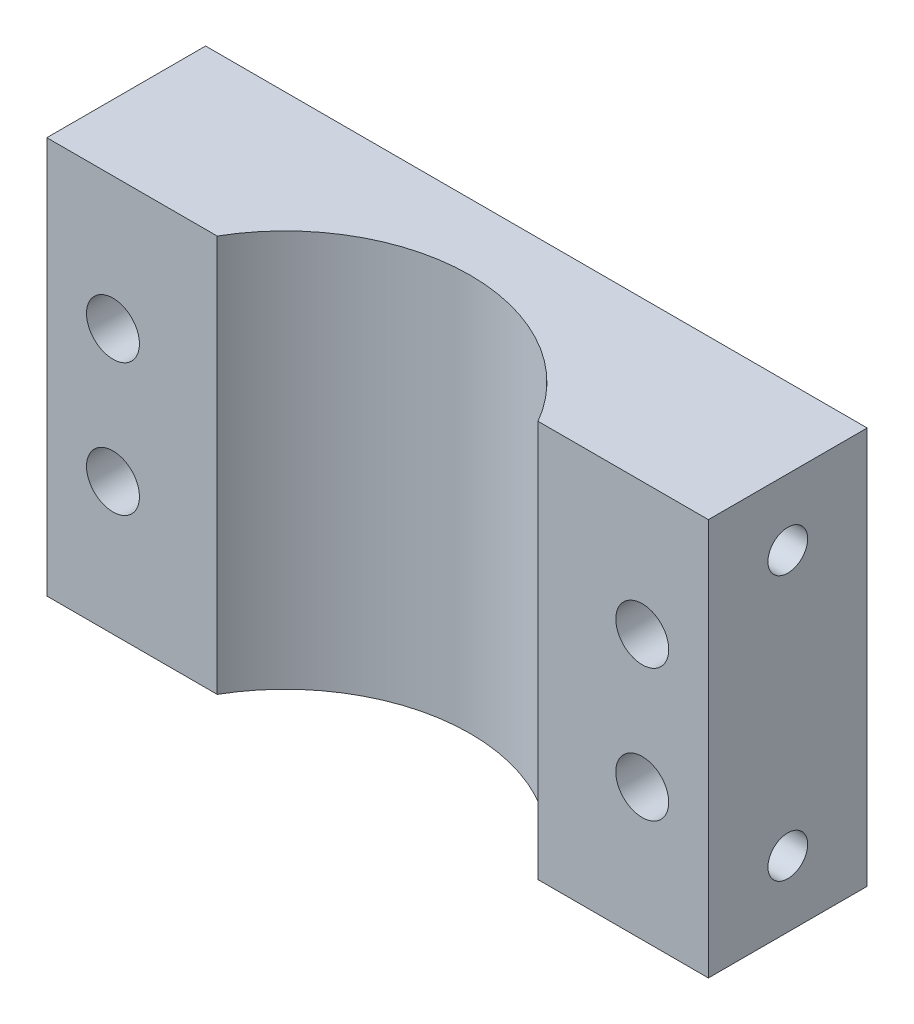
ISO-10303-21;
HEADER;
FILE_DESCRIPTION(('STEP AP214'),'2;1');
FILE_NAME('part.step','',(''),(''),'','','');
FILE_SCHEMA(('AUTOMOTIVE_DESIGN { 1 0 10303 214 1 1 1 1 }'));
ENDSEC;
DATA;
#1=APPLICATION_CONTEXT('core data for automotive mechanical design processes');
#2=APPLICATION_PROTOCOL_DEFINITION('international standard','automotive_design',2000,#1);
#3=PRODUCT_CONTEXT('',#1,'mechanical');
#4=PRODUCT('Part','Part','',(#3));
#5=PRODUCT_RELATED_PRODUCT_CATEGORY('part','',(#4));
#6=PRODUCT_DEFINITION_FORMATION('','',#4);
#7=PRODUCT_DEFINITION_CONTEXT('part definition',#1,'design');
#8=PRODUCT_DEFINITION('design','',#6,#7);
#9=PRODUCT_DEFINITION_SHAPE('','',#8);
#10=(LENGTH_UNIT() NAMED_UNIT(*) SI_UNIT(.MILLI.,.METRE.));
#11=(NAMED_UNIT(*) PLANE_ANGLE_UNIT() SI_UNIT($,.RADIAN.));
#12=(NAMED_UNIT(*) SI_UNIT($,.STERADIAN.) SOLID_ANGLE_UNIT());
#13=UNCERTAINTY_MEASURE_WITH_UNIT(LENGTH_MEASURE(1.E-05),#10,'distance_accuracy_value','');
#14=(GEOMETRIC_REPRESENTATION_CONTEXT(3) GLOBAL_UNCERTAINTY_ASSIGNED_CONTEXT((#13)) GLOBAL_UNIT_ASSIGNED_CONTEXT((#10,
#11,#12)) REPRESENTATION_CONTEXT('',''));
#15=CARTESIAN_POINT('',(0.,0.,0.));
#16=DIRECTION('',(0.,0.,1.));
#17=DIRECTION('',(1.,0.,0.));
#18=AXIS2_PLACEMENT_3D('',#15,#16,#17);
#19=CARTESIAN_POINT('',(0.,30.,0.));
#20=DIRECTION('',(0.,-1.,0.));
#21=DIRECTION('',(0.,0.,-1.));
#22=AXIS2_PLACEMENT_3D('',#19,#20,#21);
#23=CYLINDRICAL_SURFACE('',#22,14.);
#24=CARTESIAN_POINT('',(0.,0.,0.));
#25=DIRECTION('',(0.,1.,0.));
#26=DIRECTION('',(0.,0.,1.));
#27=AXIS2_PLACEMENT_3D('',#24,#25,#26);
#28=CIRCLE('',#27,14.);
#29=CARTESIAN_POINT('',(-12.1243556529821,0.,-7.));
#30=VERTEX_POINT('',#29);
#31=CARTESIAN_POINT('',(12.1243556529821,0.,-7.));
#32=VERTEX_POINT('',#31);
#33=EDGE_CURVE('E130',#30,#32,#28,.F.);
#34=ORIENTED_EDGE('',*,*,#33,.T.);
#35=DIRECTION('',(0.,-1.,0.));
#36=VECTOR('',#35,1.);
#37=CARTESIAN_POINT('',(12.1243556529821,30.,-7.));
#38=LINE('',#37,#36);
#39=CARTESIAN_POINT('',(12.1243556529821,30.,-7.));
#40=VERTEX_POINT('',#39);
#41=EDGE_CURVE('E43',#40,#32,#38,.T.);
#42=ORIENTED_EDGE('',*,*,#41,.F.);
#43=CARTESIAN_POINT('',(0.,30.,0.));
#44=DIRECTION('',(0.,1.,0.));
#45=DIRECTION('',(0.,0.,1.));
#46=AXIS2_PLACEMENT_3D('',#43,#44,#45);
#47=CIRCLE('',#46,14.);
#48=CARTESIAN_POINT('',(-12.1243556529821,30.,-7.));
#49=VERTEX_POINT('',#48);
#50=EDGE_CURVE('E50',#49,#40,#47,.F.);
#51=ORIENTED_EDGE('',*,*,#50,.F.);
#52=DIRECTION('',(0.,-1.,0.));
#53=VECTOR('',#52,1.);
#54=CARTESIAN_POINT('',(-12.1243556529821,30.,-7.));
#55=LINE('',#54,#53);
#56=EDGE_CURVE('E11',#49,#30,#55,.T.);
#57=ORIENTED_EDGE('',*,*,#56,.T.);
#58=EDGE_LOOP('',(#34,#42,#51,#57));
#59=FACE_BOUND('',#58,.T.);
#60=ADVANCED_FACE('F35',(#59),#23,.F.);
#61=CARTESIAN_POINT('',(0.,30.,-19.));
#62=DIRECTION('',(0.,0.,-1.));
#63=DIRECTION('',(-1.,0.,0.));
#64=AXIS2_PLACEMENT_3D('',#61,#62,#63);
#65=PLANE('',#64);
#66=CARTESIAN_POINT('',(20.,20.,-19.));
#67=DIRECTION('',(0.,0.,-1.));
#68=DIRECTION('',(-1.,0.,0.));
#69=AXIS2_PLACEMENT_3D('',#66,#67,#68);
#70=CIRCLE('',#69,2.00000000000001);
#71=CARTESIAN_POINT('',(18.,20.,-19.));
#72=VERTEX_POINT('',#71);
#73=EDGE_CURVE('E230',#72,#72,#70,.T.);
#74=ORIENTED_EDGE('',*,*,#73,.F.);
#75=EDGE_LOOP('',(#74));
#76=FACE_BOUND('',#75,.T.);
#77=CARTESIAN_POINT('',(-20.,20.,-19.));
#78=DIRECTION('',(0.,0.,-1.));
#79=DIRECTION('',(-1.,0.,0.));
#80=AXIS2_PLACEMENT_3D('',#77,#78,#79);
#81=CIRCLE('',#80,2.00000000000001);
#82=CARTESIAN_POINT('',(-22.,20.,-19.));
#83=VERTEX_POINT('',#82);
#84=EDGE_CURVE('E234',#83,#83,#81,.T.);
#85=ORIENTED_EDGE('',*,*,#84,.F.);
#86=EDGE_LOOP('',(#85));
#87=FACE_BOUND('',#86,.T.);
#88=CARTESIAN_POINT('',(-20.,10.,-19.));
#89=DIRECTION('',(0.,0.,-1.));
#90=DIRECTION('',(-1.,0.,0.));
#91=AXIS2_PLACEMENT_3D('',#88,#89,#90);
#92=CIRCLE('',#91,2.);
#93=CARTESIAN_POINT('',(-22.,10.,-19.));
#94=VERTEX_POINT('',#93);
#95=EDGE_CURVE('E241',#94,#94,#92,.T.);
#96=ORIENTED_EDGE('',*,*,#95,.F.);
#97=EDGE_LOOP('',(#96));
#98=FACE_BOUND('',#97,.T.);
#99=CARTESIAN_POINT('',(20.,10.,-19.));
#100=DIRECTION('',(0.,0.,-1.));
#101=DIRECTION('',(-1.,0.,0.));
#102=AXIS2_PLACEMENT_3D('',#99,#100,#101);
#103=CIRCLE('',#102,2.);
#104=CARTESIAN_POINT('',(18.,10.,-19.));
#105=VERTEX_POINT('',#104);
#106=EDGE_CURVE('E244',#105,#105,#103,.T.);
#107=ORIENTED_EDGE('',*,*,#106,.F.);
#108=EDGE_LOOP('',(#107));
#109=FACE_BOUND('',#108,.T.);
#110=DIRECTION('',(1.,0.,0.));
#111=VECTOR('',#110,1.);
#112=CARTESIAN_POINT('',(0.,0.,-19.));
#113=LINE('',#112,#111);
#114=CARTESIAN_POINT('',(-25.,0.,-19.));
#115=VERTEX_POINT('',#114);
#116=CARTESIAN_POINT('',(25.,0.,-19.));
#117=VERTEX_POINT('',#116);
#118=EDGE_CURVE('E131',#115,#117,#113,.T.);
#119=ORIENTED_EDGE('',*,*,#118,.F.);
#120=DIRECTION('',(0.,-1.,0.));
#121=VECTOR('',#120,1.);
#122=CARTESIAN_POINT('',(-25.,30.,-19.));
#123=LINE('',#122,#121);
#124=CARTESIAN_POINT('',(-25.,30.,-19.));
#125=VERTEX_POINT('',#124);
#126=EDGE_CURVE('E88',#125,#115,#123,.T.);
#127=ORIENTED_EDGE('',*,*,#126,.F.);
#128=DIRECTION('',(1.,0.,0.));
#129=VECTOR('',#128,1.);
#130=CARTESIAN_POINT('',(0.,30.,-19.));
#131=LINE('',#130,#129);
#132=CARTESIAN_POINT('',(25.,30.,-19.));
#133=VERTEX_POINT('',#132);
#134=EDGE_CURVE('E82',#125,#133,#131,.T.);
#135=ORIENTED_EDGE('',*,*,#134,.T.);
#136=DIRECTION('',(0.,-1.,0.));
#137=VECTOR('',#136,1.);
#138=CARTESIAN_POINT('',(25.,30.,-19.));
#139=LINE('',#138,#137);
#140=EDGE_CURVE('E85',#133,#117,#139,.T.);
#141=ORIENTED_EDGE('',*,*,#140,.T.);
#142=EDGE_LOOP('',(#119,#127,#135,#141));
#143=FACE_BOUND('',#142,.T.);
#144=ADVANCED_FACE('F84',(#76,#87,#98,#109,#143),#65,.T.);
#145=CARTESIAN_POINT('',(0.,30.,0.));
#146=DIRECTION('',(0.,1.,0.));
#147=DIRECTION('',(0.,0.,1.));
#148=AXIS2_PLACEMENT_3D('',#145,#146,#147);
#149=PLANE('',#148);
#150=ORIENTED_EDGE('',*,*,#134,.F.);
#151=DIRECTION('',(0.,0.,1.));
#152=VECTOR('',#151,1.);
#153=CARTESIAN_POINT('',(-25.,30.,0.));
#154=LINE('',#153,#152);
#155=CARTESIAN_POINT('',(-25.,30.,-7.));
#156=VERTEX_POINT('',#155);
#157=EDGE_CURVE('E117',#125,#156,#154,.T.);
#158=ORIENTED_EDGE('',*,*,#157,.T.);
#159=DIRECTION('',(-1.,0.,0.));
#160=VECTOR('',#159,1.);
#161=CARTESIAN_POINT('',(0.,30.,-7.));
#162=LINE('',#161,#160);
#163=EDGE_CURVE('E119',#49,#156,#162,.T.);
#164=ORIENTED_EDGE('',*,*,#163,.F.);
#165=ORIENTED_EDGE('',*,*,#50,.T.);
#166=DIRECTION('',(1.,0.,0.));
#167=VECTOR('',#166,1.);
#168=CARTESIAN_POINT('',(0.,30.,-7.));
#169=LINE('',#168,#167);
#170=CARTESIAN_POINT('',(25.,30.,-7.));
#171=VERTEX_POINT('',#170);
#172=EDGE_CURVE('E103',#40,#171,#169,.T.);
#173=ORIENTED_EDGE('',*,*,#172,.T.);
#174=DIRECTION('',(0.,0.,1.));
#175=VECTOR('',#174,1.);
#176=CARTESIAN_POINT('',(25.,30.,0.));
#177=LINE('',#176,#175);
#178=EDGE_CURVE('E95',#133,#171,#177,.T.);
#179=ORIENTED_EDGE('',*,*,#178,.F.);
#180=EDGE_LOOP('',(#150,#158,#164,#165,#173,#179));
#181=FACE_BOUND('',#180,.T.);
#182=ADVANCED_FACE('F101',(#181),#149,.T.);
#183=CARTESIAN_POINT('',(0.,0.,0.));
#184=DIRECTION('',(0.,1.,0.));
#185=DIRECTION('',(0.,0.,1.));
#186=AXIS2_PLACEMENT_3D('',#183,#184,#185);
#187=PLANE('',#186);
#188=ORIENTED_EDGE('',*,*,#33,.F.);
#189=DIRECTION('',(-1.,0.,0.));
#190=VECTOR('',#189,1.);
#191=CARTESIAN_POINT('',(0.,0.,-7.));
#192=LINE('',#191,#190);
#193=CARTESIAN_POINT('',(-25.,0.,-7.));
#194=VERTEX_POINT('',#193);
#195=EDGE_CURVE('E120',#30,#194,#192,.T.);
#196=ORIENTED_EDGE('',*,*,#195,.T.);
#197=DIRECTION('',(0.,0.,1.));
#198=VECTOR('',#197,1.);
#199=CARTESIAN_POINT('',(-25.,0.,0.));
#200=LINE('',#199,#198);
#201=EDGE_CURVE('E98',#115,#194,#200,.T.);
#202=ORIENTED_EDGE('',*,*,#201,.F.);
#203=ORIENTED_EDGE('',*,*,#118,.T.);
#204=DIRECTION('',(0.,0.,1.));
#205=VECTOR('',#204,1.);
#206=CARTESIAN_POINT('',(25.,0.,0.));
#207=LINE('',#206,#205);
#208=CARTESIAN_POINT('',(25.,0.,-7.));
#209=VERTEX_POINT('',#208);
#210=EDGE_CURVE('E97',#117,#209,#207,.T.);
#211=ORIENTED_EDGE('',*,*,#210,.T.);
#212=DIRECTION('',(1.,0.,0.));
#213=VECTOR('',#212,1.);
#214=CARTESIAN_POINT('',(0.,0.,-7.));
#215=LINE('',#214,#213);
#216=EDGE_CURVE('E105',#32,#209,#215,.T.);
#217=ORIENTED_EDGE('',*,*,#216,.F.);
#218=EDGE_LOOP('',(#188,#196,#202,#203,#211,#217));
#219=FACE_BOUND('',#218,.T.);
#220=ADVANCED_FACE('F141',(#219),#187,.F.);
#221=CARTESIAN_POINT('',(-25.,30.,0.));
#222=DIRECTION('',(1.,0.,0.));
#223=DIRECTION('',(0.,0.,-1.));
#224=AXIS2_PLACEMENT_3D('',#221,#222,#223);
#225=PLANE('',#224);
#226=CARTESIAN_POINT('',(-25.,5.,-13.));
#227=DIRECTION('',(-1.,0.,0.));
#228=DIRECTION('',(0.,0.,1.));
#229=AXIS2_PLACEMENT_3D('',#226,#227,#228);
#230=CIRCLE('',#229,1.5);
#231=CARTESIAN_POINT('',(-25.,5.,-11.5));
#232=VERTEX_POINT('',#231);
#233=EDGE_CURVE('E253',#232,#232,#230,.T.);
#234=ORIENTED_EDGE('',*,*,#233,.F.);
#235=EDGE_LOOP('',(#234));
#236=FACE_BOUND('',#235,.T.);
#237=CARTESIAN_POINT('',(-25.,25.,-13.));
#238=DIRECTION('',(-1.,0.,0.));
#239=DIRECTION('',(0.,0.,1.));
#240=AXIS2_PLACEMENT_3D('',#237,#238,#239);
#241=CIRCLE('',#240,1.5);
#242=CARTESIAN_POINT('',(-25.,25.,-11.5));
#243=VERTEX_POINT('',#242);
#244=EDGE_CURVE('E256',#243,#243,#241,.T.);
#245=ORIENTED_EDGE('',*,*,#244,.F.);
#246=EDGE_LOOP('',(#245));
#247=FACE_BOUND('',#246,.T.);
#248=ORIENTED_EDGE('',*,*,#201,.T.);
#249=DIRECTION('',(0.,-1.,0.));
#250=VECTOR('',#249,1.);
#251=CARTESIAN_POINT('',(-25.,30.,-7.));
#252=LINE('',#251,#250);
#253=EDGE_CURVE('E123',#156,#194,#252,.T.);
#254=ORIENTED_EDGE('',*,*,#253,.F.);
#255=ORIENTED_EDGE('',*,*,#157,.F.);
#256=ORIENTED_EDGE('',*,*,#126,.T.);
#257=EDGE_LOOP('',(#248,#254,#255,#256));
#258=FACE_BOUND('',#257,.T.);
#259=ADVANCED_FACE('F146',(#236,#247,#258),#225,.F.);
#260=CARTESIAN_POINT('',(0.,30.,-7.));
#261=DIRECTION('',(0.,0.,1.));
#262=DIRECTION('',(1.,0.,0.));
#263=AXIS2_PLACEMENT_3D('',#260,#261,#262);
#264=PLANE('',#263);
#265=CARTESIAN_POINT('',(-20.,20.,-7.));
#266=DIRECTION('',(0.,0.,-1.));
#267=DIRECTION('',(-1.,0.,0.));
#268=AXIS2_PLACEMENT_3D('',#265,#266,#267);
#269=CIRCLE('',#268,2.00000000000001);
#270=CARTESIAN_POINT('',(-22.,20.,-7.));
#271=VERTEX_POINT('',#270);
#272=EDGE_CURVE('E231',#271,#271,#269,.T.);
#273=ORIENTED_EDGE('',*,*,#272,.T.);
#274=EDGE_LOOP('',(#273));
#275=FACE_BOUND('',#274,.T.);
#276=CARTESIAN_POINT('',(-20.,10.,-7.));
#277=DIRECTION('',(0.,0.,-1.));
#278=DIRECTION('',(-1.,0.,0.));
#279=AXIS2_PLACEMENT_3D('',#276,#277,#278);
#280=CIRCLE('',#279,2.);
#281=CARTESIAN_POINT('',(-22.,10.,-7.));
#282=VERTEX_POINT('',#281);
#283=EDGE_CURVE('E239',#282,#282,#280,.T.);
#284=ORIENTED_EDGE('',*,*,#283,.T.);
#285=EDGE_LOOP('',(#284));
#286=FACE_BOUND('',#285,.T.);
#287=ORIENTED_EDGE('',*,*,#195,.F.);
#288=ORIENTED_EDGE('',*,*,#56,.F.);
#289=ORIENTED_EDGE('',*,*,#163,.T.);
#290=ORIENTED_EDGE('',*,*,#253,.T.);
#291=EDGE_LOOP('',(#287,#288,#289,#290));
#292=FACE_BOUND('',#291,.T.);
#293=ADVANCED_FACE('F149',(#275,#286,#292),#264,.T.);
#294=CARTESIAN_POINT('',(25.,30.,0.));
#295=DIRECTION('',(1.,0.,0.));
#296=DIRECTION('',(0.,0.,-1.));
#297=AXIS2_PLACEMENT_3D('',#294,#295,#296);
#298=PLANE('',#297);
#299=CARTESIAN_POINT('',(25.,5.,-13.));
#300=DIRECTION('',(1.,0.,0.));
#301=DIRECTION('',(0.,0.,-1.));
#302=AXIS2_PLACEMENT_3D('',#299,#300,#301);
#303=CIRCLE('',#302,1.5);
#304=CARTESIAN_POINT('',(25.,5.,-14.5));
#305=VERTEX_POINT('',#304);
#306=EDGE_CURVE('E262',#305,#305,#303,.T.);
#307=ORIENTED_EDGE('',*,*,#306,.F.);
#308=EDGE_LOOP('',(#307));
#309=FACE_BOUND('',#308,.T.);
#310=CARTESIAN_POINT('',(25.,25.,-13.));
#311=DIRECTION('',(1.,0.,0.));
#312=DIRECTION('',(0.,0.,-1.));
#313=AXIS2_PLACEMENT_3D('',#310,#311,#312);
#314=CIRCLE('',#313,1.5);
#315=CARTESIAN_POINT('',(25.,25.,-14.5));
#316=VERTEX_POINT('',#315);
#317=EDGE_CURVE('E111',#316,#316,#314,.T.);
#318=ORIENTED_EDGE('',*,*,#317,.F.);
#319=EDGE_LOOP('',(#318));
#320=FACE_BOUND('',#319,.T.);
#321=ORIENTED_EDGE('',*,*,#210,.F.);
#322=ORIENTED_EDGE('',*,*,#140,.F.);
#323=ORIENTED_EDGE('',*,*,#178,.T.);
#324=DIRECTION('',(0.,-1.,0.));
#325=VECTOR('',#324,1.);
#326=CARTESIAN_POINT('',(25.,30.,-7.));
#327=LINE('',#326,#325);
#328=EDGE_CURVE('E99',#171,#209,#327,.T.);
#329=ORIENTED_EDGE('',*,*,#328,.T.);
#330=EDGE_LOOP('',(#321,#322,#323,#329));
#331=FACE_BOUND('',#330,.T.);
#332=ADVANCED_FACE('F94',(#309,#320,#331),#298,.T.);
#333=CARTESIAN_POINT('',(0.,30.,-7.));
#334=DIRECTION('',(0.,0.,-1.));
#335=DIRECTION('',(-1.,0.,0.));
#336=AXIS2_PLACEMENT_3D('',#333,#334,#335);
#337=PLANE('',#336);
#338=CARTESIAN_POINT('',(20.,20.,-7.));
#339=DIRECTION('',(0.,0.,-1.));
#340=DIRECTION('',(-1.,0.,0.));
#341=AXIS2_PLACEMENT_3D('',#338,#339,#340);
#342=CIRCLE('',#341,2.00000000000001);
#343=CARTESIAN_POINT('',(18.,20.,-7.));
#344=VERTEX_POINT('',#343);
#345=EDGE_CURVE('E228',#344,#344,#342,.T.);
#346=ORIENTED_EDGE('',*,*,#345,.T.);
#347=EDGE_LOOP('',(#346));
#348=FACE_BOUND('',#347,.T.);
#349=CARTESIAN_POINT('',(20.,10.,-7.));
#350=DIRECTION('',(0.,0.,-1.));
#351=DIRECTION('',(-1.,0.,0.));
#352=AXIS2_PLACEMENT_3D('',#349,#350,#351);
#353=CIRCLE('',#352,2.);
#354=CARTESIAN_POINT('',(18.,10.,-7.));
#355=VERTEX_POINT('',#354);
#356=EDGE_CURVE('E247',#355,#355,#353,.T.);
#357=ORIENTED_EDGE('',*,*,#356,.T.);
#358=EDGE_LOOP('',(#357));
#359=FACE_BOUND('',#358,.T.);
#360=ORIENTED_EDGE('',*,*,#216,.T.);
#361=ORIENTED_EDGE('',*,*,#328,.F.);
#362=ORIENTED_EDGE('',*,*,#172,.F.);
#363=ORIENTED_EDGE('',*,*,#41,.T.);
#364=EDGE_LOOP('',(#360,#361,#362,#363));
#365=FACE_BOUND('',#364,.T.);
#366=ADVANCED_FACE('F137',(#348,#359,#365),#337,.F.);
#367=CARTESIAN_POINT('',(22.,25.,-13.));
#368=DIRECTION('',(1.,0.,0.));
#369=DIRECTION('',(0.,0.,-1.));
#370=AXIS2_PLACEMENT_3D('',#367,#368,#369);
#371=CYLINDRICAL_SURFACE('',#370,1.5);
#372=CARTESIAN_POINT('',(22.,25.,-13.));
#373=DIRECTION('',(1.,0.,0.));
#374=DIRECTION('',(0.,0.,-1.));
#375=AXIS2_PLACEMENT_3D('',#372,#373,#374);
#376=CIRCLE('',#375,1.5);
#377=CARTESIAN_POINT('',(22.,25.,-14.5));
#378=VERTEX_POINT('',#377);
#379=EDGE_CURVE('E114',#378,#378,#376,.T.);
#380=ORIENTED_EDGE('',*,*,#379,.F.);
#381=EDGE_LOOP('',(#380));
#382=FACE_BOUND('',#381,.T.);
#383=ORIENTED_EDGE('',*,*,#317,.T.);
#384=EDGE_LOOP('',(#383));
#385=FACE_BOUND('',#384,.T.);
#386=ADVANCED_FACE('F175',(#382,#385),#371,.F.);
#387=CARTESIAN_POINT('',(22.,25.,-13.));
#388=DIRECTION('',(1.,0.,0.));
#389=DIRECTION('',(0.,0.,-1.));
#390=AXIS2_PLACEMENT_3D('',#387,#388,#389);
#391=PLANE('',#390);
#392=ORIENTED_EDGE('',*,*,#379,.T.);
#393=EDGE_LOOP('',(#392));
#394=FACE_BOUND('',#393,.T.);
#395=ADVANCED_FACE('F179',(#394),#391,.T.);
#396=CARTESIAN_POINT('',(22.,5.,-13.));
#397=DIRECTION('',(1.,0.,0.));
#398=DIRECTION('',(0.,0.,-1.));
#399=AXIS2_PLACEMENT_3D('',#396,#397,#398);
#400=CYLINDRICAL_SURFACE('',#399,1.5);
#401=CARTESIAN_POINT('',(22.,5.,-13.));
#402=DIRECTION('',(1.,0.,0.));
#403=DIRECTION('',(0.,0.,-1.));
#404=AXIS2_PLACEMENT_3D('',#401,#402,#403);
#405=CIRCLE('',#404,1.5);
#406=CARTESIAN_POINT('',(22.,5.,-14.5));
#407=VERTEX_POINT('',#406);
#408=EDGE_CURVE('E265',#407,#407,#405,.T.);
#409=ORIENTED_EDGE('',*,*,#408,.F.);
#410=EDGE_LOOP('',(#409));
#411=FACE_BOUND('',#410,.T.);
#412=ORIENTED_EDGE('',*,*,#306,.T.);
#413=EDGE_LOOP('',(#412));
#414=FACE_BOUND('',#413,.T.);
#415=ADVANCED_FACE('F183',(#411,#414),#400,.F.);
#416=CARTESIAN_POINT('',(22.,5.,-13.));
#417=DIRECTION('',(1.,0.,0.));
#418=DIRECTION('',(0.,0.,-1.));
#419=AXIS2_PLACEMENT_3D('',#416,#417,#418);
#420=PLANE('',#419);
#421=ORIENTED_EDGE('',*,*,#408,.T.);
#422=EDGE_LOOP('',(#421));
#423=FACE_BOUND('',#422,.T.);
#424=ADVANCED_FACE('F187',(#423),#420,.T.);
#425=CARTESIAN_POINT('',(-22.,25.,-13.));
#426=DIRECTION('',(-1.,0.,0.));
#427=DIRECTION('',(0.,0.,1.));
#428=AXIS2_PLACEMENT_3D('',#425,#426,#427);
#429=CYLINDRICAL_SURFACE('',#428,1.5);
#430=CARTESIAN_POINT('',(-22.,25.,-13.));
#431=DIRECTION('',(-1.,0.,0.));
#432=DIRECTION('',(0.,0.,1.));
#433=AXIS2_PLACEMENT_3D('',#430,#431,#432);
#434=CIRCLE('',#433,1.5);
#435=CARTESIAN_POINT('',(-22.,25.,-11.5));
#436=VERTEX_POINT('',#435);
#437=EDGE_CURVE('E259',#436,#436,#434,.T.);
#438=ORIENTED_EDGE('',*,*,#437,.F.);
#439=EDGE_LOOP('',(#438));
#440=FACE_BOUND('',#439,.T.);
#441=ORIENTED_EDGE('',*,*,#244,.T.);
#442=EDGE_LOOP('',(#441));
#443=FACE_BOUND('',#442,.T.);
#444=ADVANCED_FACE('F191',(#440,#443),#429,.F.);
#445=CARTESIAN_POINT('',(-22.,25.,-13.));
#446=DIRECTION('',(-1.,0.,0.));
#447=DIRECTION('',(0.,0.,1.));
#448=AXIS2_PLACEMENT_3D('',#445,#446,#447);
#449=PLANE('',#448);
#450=ORIENTED_EDGE('',*,*,#437,.T.);
#451=EDGE_LOOP('',(#450));
#452=FACE_BOUND('',#451,.T.);
#453=ADVANCED_FACE('F195',(#452),#449,.T.);
#454=CARTESIAN_POINT('',(-22.,5.,-13.));
#455=DIRECTION('',(-1.,0.,0.));
#456=DIRECTION('',(0.,0.,1.));
#457=AXIS2_PLACEMENT_3D('',#454,#455,#456);
#458=CYLINDRICAL_SURFACE('',#457,1.5);
#459=CARTESIAN_POINT('',(-22.,5.,-13.));
#460=DIRECTION('',(-1.,0.,0.));
#461=DIRECTION('',(0.,0.,1.));
#462=AXIS2_PLACEMENT_3D('',#459,#460,#461);
#463=CIRCLE('',#462,1.5);
#464=CARTESIAN_POINT('',(-22.,5.,-11.5));
#465=VERTEX_POINT('',#464);
#466=EDGE_CURVE('E250',#465,#465,#463,.T.);
#467=ORIENTED_EDGE('',*,*,#466,.F.);
#468=EDGE_LOOP('',(#467));
#469=FACE_BOUND('',#468,.T.);
#470=ORIENTED_EDGE('',*,*,#233,.T.);
#471=EDGE_LOOP('',(#470));
#472=FACE_BOUND('',#471,.T.);
#473=ADVANCED_FACE('F199',(#469,#472),#458,.F.);
#474=CARTESIAN_POINT('',(-22.,5.,-13.));
#475=DIRECTION('',(-1.,0.,0.));
#476=DIRECTION('',(0.,0.,1.));
#477=AXIS2_PLACEMENT_3D('',#474,#475,#476);
#478=PLANE('',#477);
#479=ORIENTED_EDGE('',*,*,#466,.T.);
#480=EDGE_LOOP('',(#479));
#481=FACE_BOUND('',#480,.T.);
#482=ADVANCED_FACE('F201',(#481),#478,.T.);
#483=CARTESIAN_POINT('',(20.,10.,-7.));
#484=DIRECTION('',(0.,0.,-1.));
#485=DIRECTION('',(-1.,0.,0.));
#486=AXIS2_PLACEMENT_3D('',#483,#484,#485);
#487=CYLINDRICAL_SURFACE('',#486,2.);
#488=ORIENTED_EDGE('',*,*,#356,.F.);
#489=EDGE_LOOP('',(#488));
#490=FACE_BOUND('',#489,.T.);
#491=ORIENTED_EDGE('',*,*,#106,.T.);
#492=EDGE_LOOP('',(#491));
#493=FACE_BOUND('',#492,.T.);
#494=ADVANCED_FACE('F204',(#490,#493),#487,.F.);
#495=CARTESIAN_POINT('',(-20.,10.,-7.));
#496=DIRECTION('',(0.,0.,-1.));
#497=DIRECTION('',(-1.,0.,0.));
#498=AXIS2_PLACEMENT_3D('',#495,#496,#497);
#499=CYLINDRICAL_SURFACE('',#498,2.);
#500=ORIENTED_EDGE('',*,*,#283,.F.);
#501=EDGE_LOOP('',(#500));
#502=FACE_BOUND('',#501,.T.);
#503=ORIENTED_EDGE('',*,*,#95,.T.);
#504=EDGE_LOOP('',(#503));
#505=FACE_BOUND('',#504,.T.);
#506=ADVANCED_FACE('F211',(#502,#505),#499,.F.);
#507=CARTESIAN_POINT('',(-20.,20.,-7.));
#508=DIRECTION('',(0.,0.,-1.));
#509=DIRECTION('',(-1.,0.,0.));
#510=AXIS2_PLACEMENT_3D('',#507,#508,#509);
#511=CYLINDRICAL_SURFACE('',#510,2.00000000000001);
#512=ORIENTED_EDGE('',*,*,#272,.F.);
#513=EDGE_LOOP('',(#512));
#514=FACE_BOUND('',#513,.T.);
#515=ORIENTED_EDGE('',*,*,#84,.T.);
#516=EDGE_LOOP('',(#515));
#517=FACE_BOUND('',#516,.T.);
#518=ADVANCED_FACE('F215',(#514,#517),#511,.F.);
#519=CARTESIAN_POINT('',(20.,20.,-7.));
#520=DIRECTION('',(0.,0.,-1.));
#521=DIRECTION('',(-1.,0.,0.));
#522=AXIS2_PLACEMENT_3D('',#519,#520,#521);
#523=CYLINDRICAL_SURFACE('',#522,2.00000000000001);
#524=ORIENTED_EDGE('',*,*,#345,.F.);
#525=EDGE_LOOP('',(#524));
#526=FACE_BOUND('',#525,.T.);
#527=ORIENTED_EDGE('',*,*,#73,.T.);
#528=EDGE_LOOP('',(#527));
#529=FACE_BOUND('',#528,.T.);
#530=ADVANCED_FACE('F219',(#526,#529),#523,.F.);
#531=CLOSED_SHELL('',(#60,#144,#182,#220,#259,#293,#332,#366,#386,#395,#415,#424,#444,#453,#473,
#482,#494,#506,#518,#530));
#532=MANIFOLD_SOLID_BREP('B2',#531);
#533=ADVANCED_BREP_SHAPE_REPRESENTATION('',(#18,#532),#14);
#534=SHAPE_DEFINITION_REPRESENTATION(#9,#533);
ENDSEC;
END-ISO-10303-21;
